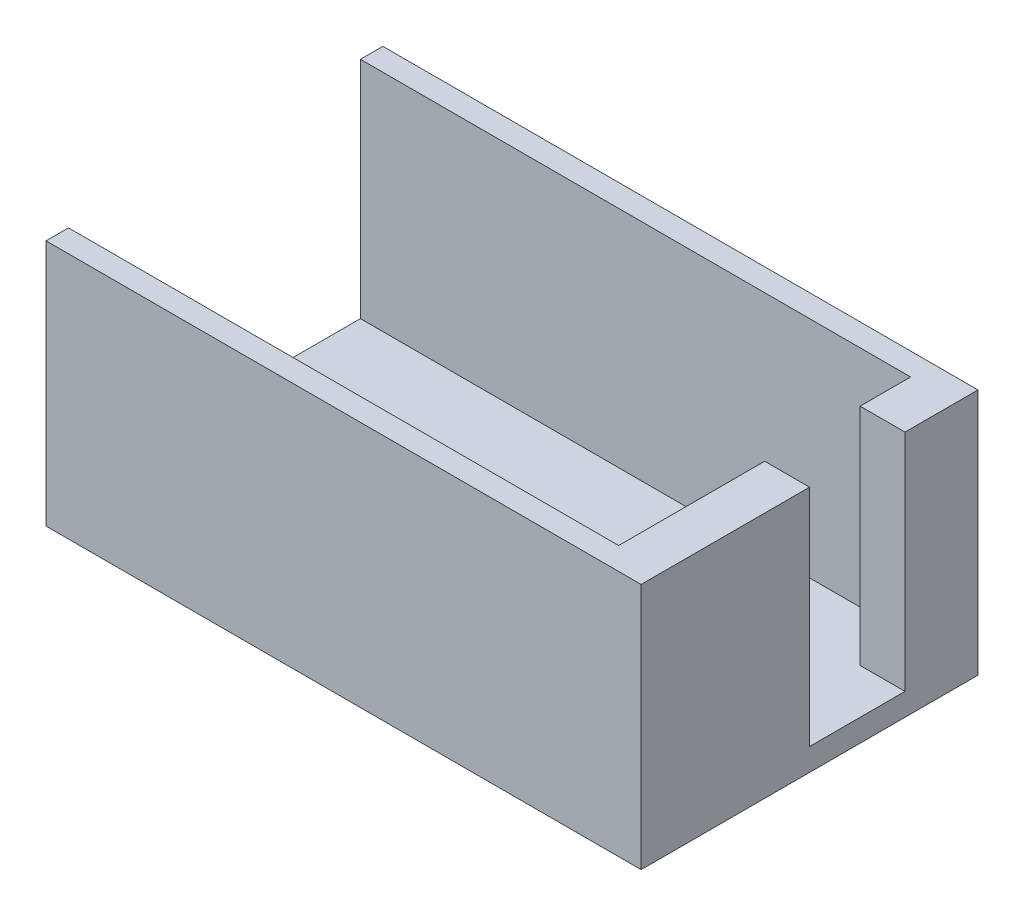
ISO-10303-21;
HEADER;
FILE_DESCRIPTION(('STEP AP214'),'2;1');
FILE_NAME('part.step','',(''),(''),'','','');
FILE_SCHEMA(('AUTOMOTIVE_DESIGN { 1 0 10303 214 1 1 1 1 }'));
ENDSEC;
DATA;
#1=APPLICATION_CONTEXT('core data for automotive mechanical design processes');
#2=APPLICATION_PROTOCOL_DEFINITION('international standard','automotive_design',2000,#1);
#3=PRODUCT_CONTEXT('',#1,'mechanical');
#4=PRODUCT('Part','Part','',(#3));
#5=PRODUCT_RELATED_PRODUCT_CATEGORY('part','',(#4));
#6=PRODUCT_DEFINITION_FORMATION('','',#4);
#7=PRODUCT_DEFINITION_CONTEXT('part definition',#1,'design');
#8=PRODUCT_DEFINITION('design','',#6,#7);
#9=PRODUCT_DEFINITION_SHAPE('','',#8);
#10=(LENGTH_UNIT() NAMED_UNIT(*) SI_UNIT(.MILLI.,.METRE.));
#11=(NAMED_UNIT(*) PLANE_ANGLE_UNIT() SI_UNIT($,.RADIAN.));
#12=(NAMED_UNIT(*) SI_UNIT($,.STERADIAN.) SOLID_ANGLE_UNIT());
#13=UNCERTAINTY_MEASURE_WITH_UNIT(LENGTH_MEASURE(1.E-05),#10,'distance_accuracy_value','');
#14=(GEOMETRIC_REPRESENTATION_CONTEXT(3) GLOBAL_UNCERTAINTY_ASSIGNED_CONTEXT((#13)) GLOBAL_UNIT_ASSIGNED_CONTEXT((#10,
#11,#12)) REPRESENTATION_CONTEXT('',''));
#15=CARTESIAN_POINT('',(0.,0.,0.));
#16=DIRECTION('',(0.,0.,1.));
#17=DIRECTION('',(1.,0.,0.));
#18=AXIS2_PLACEMENT_3D('',#15,#16,#17);
#19=CARTESIAN_POINT('',(0.,2.,0.));
#20=DIRECTION('',(0.,1.,0.));
#21=DIRECTION('',(0.,0.,1.));
#22=AXIS2_PLACEMENT_3D('',#19,#20,#21);
#23=PLANE('',#22);
#24=DIRECTION('',(0.,0.,1.));
#25=VECTOR('',#24,1.);
#26=CARTESIAN_POINT('',(49.,2.,28.));
#27=LINE('',#26,#25);
#28=CARTESIAN_POINT('',(49.,2.,15.));
#29=VERTEX_POINT('',#28);
#30=CARTESIAN_POINT('',(49.,2.,28.));
#31=VERTEX_POINT('',#30);
#32=EDGE_CURVE('E154',#29,#31,#27,.T.);
#33=ORIENTED_EDGE('',*,*,#32,.F.);
#34=DIRECTION('',(-1.,0.,0.));
#35=VECTOR('',#34,1.);
#36=CARTESIAN_POINT('',(49.,2.,15.));
#37=LINE('',#36,#35);
#38=CARTESIAN_POINT('',(53.,2.,15.));
#39=VERTEX_POINT('',#38);
#40=EDGE_CURVE('E168',#39,#29,#37,.T.);
#41=ORIENTED_EDGE('',*,*,#40,.F.);
#42=DIRECTION('',(0.,0.,-1.));
#43=VECTOR('',#42,1.);
#44=CARTESIAN_POINT('',(53.,2.,0.));
#45=LINE('',#44,#43);
#46=CARTESIAN_POINT('',(53.,2.,6.5));
#47=VERTEX_POINT('',#46);
#48=EDGE_CURVE('E233',#39,#47,#45,.T.);
#49=ORIENTED_EDGE('',*,*,#48,.T.);
#50=DIRECTION('',(1.,0.,0.));
#51=VECTOR('',#50,1.);
#52=CARTESIAN_POINT('',(49.,2.,6.5));
#53=LINE('',#52,#51);
#54=CARTESIAN_POINT('',(49.,2.,6.5));
#55=VERTEX_POINT('',#54);
#56=EDGE_CURVE('E63',#55,#47,#53,.T.);
#57=ORIENTED_EDGE('',*,*,#56,.F.);
#58=DIRECTION('',(0.,0.,1.));
#59=VECTOR('',#58,1.);
#60=CARTESIAN_POINT('',(49.,2.,6.5));
#61=LINE('',#60,#59);
#62=CARTESIAN_POINT('',(49.,2.,2.));
#63=VERTEX_POINT('',#62);
#64=EDGE_CURVE('E209',#63,#55,#61,.T.);
#65=ORIENTED_EDGE('',*,*,#64,.F.);
#66=DIRECTION('',(1.,0.,0.));
#67=VECTOR('',#66,1.);
#68=CARTESIAN_POINT('',(49.,2.,2.));
#69=LINE('',#68,#67);
#70=CARTESIAN_POINT('',(0.,2.,2.));
#71=VERTEX_POINT('',#70);
#72=EDGE_CURVE('E184',#71,#63,#69,.T.);
#73=ORIENTED_EDGE('',*,*,#72,.F.);
#74=DIRECTION('',(0.,0.,1.));
#75=VECTOR('',#74,1.);
#76=CARTESIAN_POINT('',(0.,2.,0.));
#77=LINE('',#76,#75);
#78=CARTESIAN_POINT('',(0.,2.,28.));
#79=VERTEX_POINT('',#78);
#80=EDGE_CURVE('E229',#71,#79,#77,.T.);
#81=ORIENTED_EDGE('',*,*,#80,.T.);
#82=DIRECTION('',(-1.,0.,0.));
#83=VECTOR('',#82,1.);
#84=CARTESIAN_POINT('',(0.,2.,28.));
#85=LINE('',#84,#83);
#86=EDGE_CURVE('E151',#31,#79,#85,.T.);
#87=ORIENTED_EDGE('',*,*,#86,.F.);
#88=EDGE_LOOP('',(#33,#41,#49,#57,#65,#73,#81,#87));
#89=FACE_BOUND('',#88,.T.);
#90=ADVANCED_FACE('F39',(#89),#23,.T.);
#91=CARTESIAN_POINT('',(0.,2.,0.));
#92=DIRECTION('',(1.,0.,0.));
#93=DIRECTION('',(0.,0.,-1.));
#94=AXIS2_PLACEMENT_3D('',#91,#92,#93);
#95=PLANE('',#94);
#96=DIRECTION('',(0.,0.,1.));
#97=VECTOR('',#96,1.);
#98=CARTESIAN_POINT('',(0.,0.,0.));
#99=LINE('',#98,#97);
#100=CARTESIAN_POINT('',(0.,0.,0.));
#101=VERTEX_POINT('',#100);
#102=CARTESIAN_POINT('',(0.,0.,30.));
#103=VERTEX_POINT('',#102);
#104=EDGE_CURVE('E136',#101,#103,#99,.T.);
#105=ORIENTED_EDGE('',*,*,#104,.T.);
#106=DIRECTION('',(0.,-1.,0.));
#107=VECTOR('',#106,1.);
#108=CARTESIAN_POINT('',(0.,2.,30.));
#109=LINE('',#108,#107);
#110=CARTESIAN_POINT('',(0.,22.,30.));
#111=VERTEX_POINT('',#110);
#112=EDGE_CURVE('E11',#111,#103,#109,.T.);
#113=ORIENTED_EDGE('',*,*,#112,.F.);
#114=DIRECTION('',(0.,0.,1.));
#115=VECTOR('',#114,1.);
#116=CARTESIAN_POINT('',(0.,22.,28.));
#117=LINE('',#116,#115);
#118=CARTESIAN_POINT('',(0.,22.,28.));
#119=VERTEX_POINT('',#118);
#120=EDGE_CURVE('E133',#119,#111,#117,.T.);
#121=ORIENTED_EDGE('',*,*,#120,.F.);
#122=DIRECTION('',(0.,-1.,0.));
#123=VECTOR('',#122,1.);
#124=CARTESIAN_POINT('',(0.,22.,28.));
#125=LINE('',#124,#123);
#126=EDGE_CURVE('E167',#119,#79,#125,.T.);
#127=ORIENTED_EDGE('',*,*,#126,.T.);
#128=ORIENTED_EDGE('',*,*,#80,.F.);
#129=DIRECTION('',(0.,-1.,0.));
#130=VECTOR('',#129,1.);
#131=CARTESIAN_POINT('',(0.,22.,2.));
#132=LINE('',#131,#130);
#133=CARTESIAN_POINT('',(0.,22.,2.));
#134=VERTEX_POINT('',#133);
#135=EDGE_CURVE('E225',#134,#71,#132,.T.);
#136=ORIENTED_EDGE('',*,*,#135,.F.);
#137=DIRECTION('',(0.,0.,1.));
#138=VECTOR('',#137,1.);
#139=CARTESIAN_POINT('',(0.,22.,0.));
#140=LINE('',#139,#138);
#141=CARTESIAN_POINT('',(0.,22.,0.));
#142=VERTEX_POINT('',#141);
#143=EDGE_CURVE('E189',#142,#134,#140,.T.);
#144=ORIENTED_EDGE('',*,*,#143,.F.);
#145=DIRECTION('',(0.,-1.,0.));
#146=VECTOR('',#145,1.);
#147=CARTESIAN_POINT('',(0.,2.,0.));
#148=LINE('',#147,#146);
#149=EDGE_CURVE('E237',#142,#101,#148,.T.);
#150=ORIENTED_EDGE('',*,*,#149,.T.);
#151=EDGE_LOOP('',(#105,#113,#121,#127,#128,#136,#144,#150));
#152=FACE_BOUND('',#151,.T.);
#153=ADVANCED_FACE('F41',(#152),#95,.F.);
#154=CARTESIAN_POINT('',(0.,2.,30.));
#155=DIRECTION('',(0.,0.,-1.));
#156=DIRECTION('',(-1.,0.,0.));
#157=AXIS2_PLACEMENT_3D('',#154,#155,#156);
#158=PLANE('',#157);
#159=DIRECTION('',(1.,0.,0.));
#160=VECTOR('',#159,1.);
#161=CARTESIAN_POINT('',(0.,0.,30.));
#162=LINE('',#161,#160);
#163=CARTESIAN_POINT('',(53.,0.,30.));
#164=VERTEX_POINT('',#163);
#165=EDGE_CURVE('E240',#103,#164,#162,.T.);
#166=ORIENTED_EDGE('',*,*,#165,.T.);
#167=DIRECTION('',(0.,-1.,0.));
#168=VECTOR('',#167,1.);
#169=CARTESIAN_POINT('',(53.,2.,30.));
#170=LINE('',#169,#168);
#171=CARTESIAN_POINT('',(53.,22.,30.));
#172=VERTEX_POINT('',#171);
#173=EDGE_CURVE('E48',#172,#164,#170,.T.);
#174=ORIENTED_EDGE('',*,*,#173,.F.);
#175=DIRECTION('',(1.,0.,0.));
#176=VECTOR('',#175,1.);
#177=CARTESIAN_POINT('',(0.,22.,30.));
#178=LINE('',#177,#176);
#179=EDGE_CURVE('E139',#111,#172,#178,.T.);
#180=ORIENTED_EDGE('',*,*,#179,.F.);
#181=ORIENTED_EDGE('',*,*,#112,.T.);
#182=EDGE_LOOP('',(#166,#174,#180,#181));
#183=FACE_BOUND('',#182,.T.);
#184=ADVANCED_FACE('F140',(#183),#158,.F.);
#185=CARTESIAN_POINT('',(53.,2.,0.));
#186=DIRECTION('',(-1.,0.,0.));
#187=DIRECTION('',(0.,0.,1.));
#188=AXIS2_PLACEMENT_3D('',#185,#186,#187);
#189=PLANE('',#188);
#190=DIRECTION('',(0.,0.,-1.));
#191=VECTOR('',#190,1.);
#192=CARTESIAN_POINT('',(53.,0.,0.));
#193=LINE('',#192,#191);
#194=CARTESIAN_POINT('',(53.,0.,0.));
#195=VERTEX_POINT('',#194);
#196=EDGE_CURVE('E243',#164,#195,#193,.T.);
#197=ORIENTED_EDGE('',*,*,#196,.T.);
#198=DIRECTION('',(0.,-1.,0.));
#199=VECTOR('',#198,1.);
#200=CARTESIAN_POINT('',(53.,2.,0.));
#201=LINE('',#200,#199);
#202=CARTESIAN_POINT('',(53.,22.,0.));
#203=VERTEX_POINT('',#202);
#204=EDGE_CURVE('E250',#203,#195,#201,.T.);
#205=ORIENTED_EDGE('',*,*,#204,.F.);
#206=DIRECTION('',(0.,0.,-1.));
#207=VECTOR('',#206,1.);
#208=CARTESIAN_POINT('',(53.,22.,6.5));
#209=LINE('',#208,#207);
#210=CARTESIAN_POINT('',(53.,22.,6.5));
#211=VERTEX_POINT('',#210);
#212=EDGE_CURVE('E201',#211,#203,#209,.T.);
#213=ORIENTED_EDGE('',*,*,#212,.F.);
#214=DIRECTION('',(0.,-1.,0.));
#215=VECTOR('',#214,1.);
#216=CARTESIAN_POINT('',(53.,22.,6.5));
#217=LINE('',#216,#215);
#218=EDGE_CURVE('E205',#211,#47,#217,.T.);
#219=ORIENTED_EDGE('',*,*,#218,.T.);
#220=ORIENTED_EDGE('',*,*,#48,.F.);
#221=DIRECTION('',(0.,-1.,0.));
#222=VECTOR('',#221,1.);
#223=CARTESIAN_POINT('',(53.,22.,15.));
#224=LINE('',#223,#222);
#225=CARTESIAN_POINT('',(53.,22.,15.));
#226=VERTEX_POINT('',#225);
#227=EDGE_CURVE('E181',#226,#39,#224,.T.);
#228=ORIENTED_EDGE('',*,*,#227,.F.);
#229=DIRECTION('',(0.,0.,-1.));
#230=VECTOR('',#229,1.);
#231=CARTESIAN_POINT('',(53.,22.,30.));
#232=LINE('',#231,#230);
#233=EDGE_CURVE('E145',#172,#226,#232,.T.);
#234=ORIENTED_EDGE('',*,*,#233,.F.);
#235=ORIENTED_EDGE('',*,*,#173,.T.);
#236=EDGE_LOOP('',(#197,#205,#213,#219,#220,#228,#234,#235));
#237=FACE_BOUND('',#236,.T.);
#238=ADVANCED_FACE('F256',(#237),#189,.F.);
#239=CARTESIAN_POINT('',(0.,2.,0.));
#240=DIRECTION('',(0.,0.,1.));
#241=DIRECTION('',(1.,0.,0.));
#242=AXIS2_PLACEMENT_3D('',#239,#240,#241);
#243=PLANE('',#242);
#244=DIRECTION('',(-1.,0.,0.));
#245=VECTOR('',#244,1.);
#246=CARTESIAN_POINT('',(0.,0.,0.));
#247=LINE('',#246,#245);
#248=EDGE_CURVE('E234',#195,#101,#247,.T.);
#249=ORIENTED_EDGE('',*,*,#248,.T.);
#250=ORIENTED_EDGE('',*,*,#149,.F.);
#251=DIRECTION('',(-1.,0.,0.));
#252=VECTOR('',#251,1.);
#253=CARTESIAN_POINT('',(53.,22.,0.));
#254=LINE('',#253,#252);
#255=EDGE_CURVE('E185',#203,#142,#254,.T.);
#256=ORIENTED_EDGE('',*,*,#255,.F.);
#257=ORIENTED_EDGE('',*,*,#204,.T.);
#258=EDGE_LOOP('',(#249,#250,#256,#257));
#259=FACE_BOUND('',#258,.T.);
#260=ADVANCED_FACE('F262',(#259),#243,.F.);
#261=CARTESIAN_POINT('',(0.,0.,0.));
#262=DIRECTION('',(0.,1.,0.));
#263=DIRECTION('',(0.,0.,1.));
#264=AXIS2_PLACEMENT_3D('',#261,#262,#263);
#265=PLANE('',#264);
#266=ORIENTED_EDGE('',*,*,#104,.F.);
#267=ORIENTED_EDGE('',*,*,#248,.F.);
#268=ORIENTED_EDGE('',*,*,#196,.F.);
#269=ORIENTED_EDGE('',*,*,#165,.F.);
#270=EDGE_LOOP('',(#266,#267,#268,#269));
#271=FACE_BOUND('',#270,.T.);
#272=ADVANCED_FACE('F260',(#271),#265,.F.);
#273=CARTESIAN_POINT('',(49.,22.,2.));
#274=DIRECTION('',(0.,0.,-1.));
#275=DIRECTION('',(-1.,0.,0.));
#276=AXIS2_PLACEMENT_3D('',#273,#274,#275);
#277=PLANE('',#276);
#278=ORIENTED_EDGE('',*,*,#72,.T.);
#279=DIRECTION('',(0.,-1.,0.));
#280=VECTOR('',#279,1.);
#281=CARTESIAN_POINT('',(49.,22.,2.));
#282=LINE('',#281,#280);
#283=CARTESIAN_POINT('',(49.,22.,2.));
#284=VERTEX_POINT('',#283);
#285=EDGE_CURVE('E221',#284,#63,#282,.T.);
#286=ORIENTED_EDGE('',*,*,#285,.F.);
#287=DIRECTION('',(1.,0.,0.));
#288=VECTOR('',#287,1.);
#289=CARTESIAN_POINT('',(49.,22.,2.));
#290=LINE('',#289,#288);
#291=EDGE_CURVE('E192',#134,#284,#290,.T.);
#292=ORIENTED_EDGE('',*,*,#291,.F.);
#293=ORIENTED_EDGE('',*,*,#135,.T.);
#294=EDGE_LOOP('',(#278,#286,#292,#293));
#295=FACE_BOUND('',#294,.T.);
#296=ADVANCED_FACE('F283',(#295),#277,.F.);
#297=CARTESIAN_POINT('',(49.,22.,6.5));
#298=DIRECTION('',(1.,0.,0.));
#299=DIRECTION('',(0.,0.,-1.));
#300=AXIS2_PLACEMENT_3D('',#297,#298,#299);
#301=PLANE('',#300);
#302=ORIENTED_EDGE('',*,*,#64,.T.);
#303=DIRECTION('',(0.,-1.,0.));
#304=VECTOR('',#303,1.);
#305=CARTESIAN_POINT('',(49.,22.,6.5));
#306=LINE('',#305,#304);
#307=CARTESIAN_POINT('',(49.,22.,6.5));
#308=VERTEX_POINT('',#307);
#309=EDGE_CURVE('E217',#308,#55,#306,.T.);
#310=ORIENTED_EDGE('',*,*,#309,.F.);
#311=DIRECTION('',(0.,0.,1.));
#312=VECTOR('',#311,1.);
#313=CARTESIAN_POINT('',(49.,22.,6.5));
#314=LINE('',#313,#312);
#315=EDGE_CURVE('E195',#284,#308,#314,.T.);
#316=ORIENTED_EDGE('',*,*,#315,.F.);
#317=ORIENTED_EDGE('',*,*,#285,.T.);
#318=EDGE_LOOP('',(#302,#310,#316,#317));
#319=FACE_BOUND('',#318,.T.);
#320=ADVANCED_FACE('F279',(#319),#301,.F.);
#321=CARTESIAN_POINT('',(49.,22.,6.5));
#322=DIRECTION('',(0.,0.,-1.));
#323=DIRECTION('',(-1.,0.,0.));
#324=AXIS2_PLACEMENT_3D('',#321,#322,#323);
#325=PLANE('',#324);
#326=ORIENTED_EDGE('',*,*,#56,.T.);
#327=ORIENTED_EDGE('',*,*,#218,.F.);
#328=DIRECTION('',(1.,0.,0.));
#329=VECTOR('',#328,1.);
#330=CARTESIAN_POINT('',(49.,22.,6.5));
#331=LINE('',#330,#329);
#332=EDGE_CURVE('E198',#308,#211,#331,.T.);
#333=ORIENTED_EDGE('',*,*,#332,.F.);
#334=ORIENTED_EDGE('',*,*,#309,.T.);
#335=EDGE_LOOP('',(#326,#327,#333,#334));
#336=FACE_BOUND('',#335,.T.);
#337=ADVANCED_FACE('F275',(#336),#325,.F.);
#338=CARTESIAN_POINT('',(0.,22.,0.));
#339=DIRECTION('',(0.,1.,0.));
#340=DIRECTION('',(0.,0.,1.));
#341=AXIS2_PLACEMENT_3D('',#338,#339,#340);
#342=PLANE('',#341);
#343=ORIENTED_EDGE('',*,*,#255,.T.);
#344=ORIENTED_EDGE('',*,*,#143,.T.);
#345=ORIENTED_EDGE('',*,*,#291,.T.);
#346=ORIENTED_EDGE('',*,*,#315,.T.);
#347=ORIENTED_EDGE('',*,*,#332,.T.);
#348=ORIENTED_EDGE('',*,*,#212,.T.);
#349=EDGE_LOOP('',(#343,#344,#345,#346,#347,#348));
#350=FACE_BOUND('',#349,.T.);
#351=ADVANCED_FACE('F269',(#350),#342,.T.);
#352=CARTESIAN_POINT('',(49.,22.,15.));
#353=DIRECTION('',(0.,0.,1.));
#354=DIRECTION('',(1.,0.,0.));
#355=AXIS2_PLACEMENT_3D('',#352,#353,#354);
#356=PLANE('',#355);
#357=ORIENTED_EDGE('',*,*,#40,.T.);
#358=DIRECTION('',(0.,-1.,0.));
#359=VECTOR('',#358,1.);
#360=CARTESIAN_POINT('',(49.,22.,15.));
#361=LINE('',#360,#359);
#362=CARTESIAN_POINT('',(49.,22.,15.));
#363=VERTEX_POINT('',#362);
#364=EDGE_CURVE('E177',#363,#29,#361,.T.);
#365=ORIENTED_EDGE('',*,*,#364,.F.);
#366=DIRECTION('',(-1.,0.,0.));
#367=VECTOR('',#366,1.);
#368=CARTESIAN_POINT('',(49.,22.,15.));
#369=LINE('',#368,#367);
#370=EDGE_CURVE('E159',#226,#363,#369,.T.);
#371=ORIENTED_EDGE('',*,*,#370,.F.);
#372=ORIENTED_EDGE('',*,*,#227,.T.);
#373=EDGE_LOOP('',(#357,#365,#371,#372));
#374=FACE_BOUND('',#373,.T.);
#375=ADVANCED_FACE('F374',(#374),#356,.F.);
#376=CARTESIAN_POINT('',(49.,22.,28.));
#377=DIRECTION('',(1.,0.,0.));
#378=DIRECTION('',(0.,0.,-1.));
#379=AXIS2_PLACEMENT_3D('',#376,#377,#378);
#380=PLANE('',#379);
#381=ORIENTED_EDGE('',*,*,#32,.T.);
#382=DIRECTION('',(0.,-1.,0.));
#383=VECTOR('',#382,1.);
#384=CARTESIAN_POINT('',(49.,22.,28.));
#385=LINE('',#384,#383);
#386=CARTESIAN_POINT('',(49.,22.,28.));
#387=VERTEX_POINT('',#386);
#388=EDGE_CURVE('E55',#387,#31,#385,.T.);
#389=ORIENTED_EDGE('',*,*,#388,.F.);
#390=DIRECTION('',(0.,0.,1.));
#391=VECTOR('',#390,1.);
#392=CARTESIAN_POINT('',(49.,22.,28.));
#393=LINE('',#392,#391);
#394=EDGE_CURVE('E162',#363,#387,#393,.T.);
#395=ORIENTED_EDGE('',*,*,#394,.F.);
#396=ORIENTED_EDGE('',*,*,#364,.T.);
#397=EDGE_LOOP('',(#381,#389,#395,#396));
#398=FACE_BOUND('',#397,.T.);
#399=ADVANCED_FACE('F382',(#398),#380,.F.);
#400=CARTESIAN_POINT('',(0.,22.,28.));
#401=DIRECTION('',(0.,0.,1.));
#402=DIRECTION('',(1.,0.,0.));
#403=AXIS2_PLACEMENT_3D('',#400,#401,#402);
#404=PLANE('',#403);
#405=ORIENTED_EDGE('',*,*,#86,.T.);
#406=ORIENTED_EDGE('',*,*,#126,.F.);
#407=DIRECTION('',(-1.,0.,0.));
#408=VECTOR('',#407,1.);
#409=CARTESIAN_POINT('',(0.,22.,28.));
#410=LINE('',#409,#408);
#411=EDGE_CURVE('E148',#387,#119,#410,.T.);
#412=ORIENTED_EDGE('',*,*,#411,.F.);
#413=ORIENTED_EDGE('',*,*,#388,.T.);
#414=EDGE_LOOP('',(#405,#406,#412,#413));
#415=FACE_BOUND('',#414,.T.);
#416=ADVANCED_FACE('F391',(#415),#404,.F.);
#417=CARTESIAN_POINT('',(0.,22.,0.));
#418=DIRECTION('',(0.,1.,0.));
#419=DIRECTION('',(0.,0.,1.));
#420=AXIS2_PLACEMENT_3D('',#417,#418,#419);
#421=PLANE('',#420);
#422=ORIENTED_EDGE('',*,*,#120,.T.);
#423=ORIENTED_EDGE('',*,*,#179,.T.);
#424=ORIENTED_EDGE('',*,*,#233,.T.);
#425=ORIENTED_EDGE('',*,*,#370,.T.);
#426=ORIENTED_EDGE('',*,*,#394,.T.);
#427=ORIENTED_EDGE('',*,*,#411,.T.);
#428=EDGE_LOOP('',(#422,#423,#424,#425,#426,#427));
#429=FACE_BOUND('',#428,.T.);
#430=ADVANCED_FACE('F147',(#429),#421,.T.);
#431=CLOSED_SHELL('',(#90,#153,#184,#238,#260,#272,#296,#320,#337,#351,#375,#399,#416,#430));
#432=MANIFOLD_SOLID_BREP('B2',#431);
#433=ADVANCED_BREP_SHAPE_REPRESENTATION('',(#18,#432),#14);
#434=SHAPE_DEFINITION_REPRESENTATION(#9,#433);
ENDSEC;
END-ISO-10303-21;
